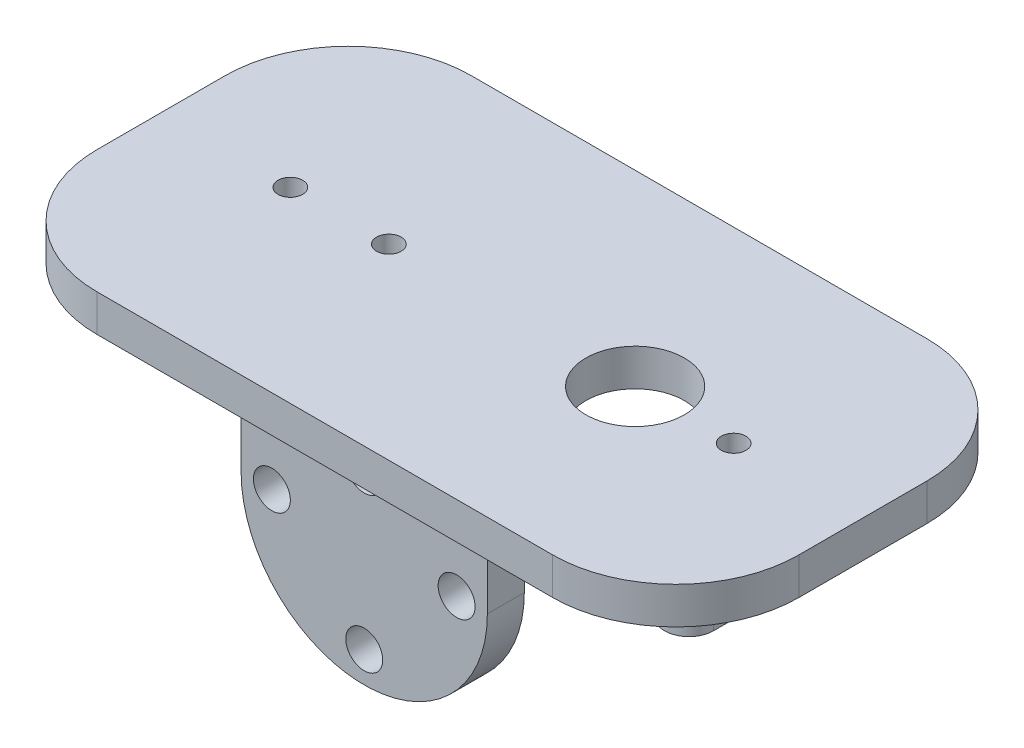
ISO-10303-21;
HEADER;
FILE_DESCRIPTION(('STEP AP214'),'2;1');
FILE_NAME('part.step','',(''),(''),'','','');
FILE_SCHEMA(('AUTOMOTIVE_DESIGN { 1 0 10303 214 1 1 1 1 }'));
ENDSEC;
DATA;
#1=APPLICATION_CONTEXT('core data for automotive mechanical design processes');
#2=APPLICATION_PROTOCOL_DEFINITION('international standard','automotive_design',2000,#1);
#3=PRODUCT_CONTEXT('',#1,'mechanical');
#4=PRODUCT('Part','Part','',(#3));
#5=PRODUCT_RELATED_PRODUCT_CATEGORY('part','',(#4));
#6=PRODUCT_DEFINITION_FORMATION('','',#4);
#7=PRODUCT_DEFINITION_CONTEXT('part definition',#1,'design');
#8=PRODUCT_DEFINITION('design','',#6,#7);
#9=PRODUCT_DEFINITION_SHAPE('','',#8);
#10=(LENGTH_UNIT() NAMED_UNIT(*) SI_UNIT(.MILLI.,.METRE.));
#11=(NAMED_UNIT(*) PLANE_ANGLE_UNIT() SI_UNIT($,.RADIAN.));
#12=(NAMED_UNIT(*) SI_UNIT($,.STERADIAN.) SOLID_ANGLE_UNIT());
#13=UNCERTAINTY_MEASURE_WITH_UNIT(LENGTH_MEASURE(1.E-05),#10,'distance_accuracy_value','');
#14=(GEOMETRIC_REPRESENTATION_CONTEXT(3) GLOBAL_UNCERTAINTY_ASSIGNED_CONTEXT((#13)) GLOBAL_UNIT_ASSIGNED_CONTEXT((#10,
#11,#12)) REPRESENTATION_CONTEXT('',''));
#15=CARTESIAN_POINT('',(0.,0.,0.));
#16=DIRECTION('',(0.,0.,1.));
#17=DIRECTION('',(1.,0.,0.));
#18=AXIS2_PLACEMENT_3D('',#15,#16,#17);
#19=CARTESIAN_POINT('',(-28.5,0.,-5.19999999999999));
#20=DIRECTION('',(0.,-1.,0.));
#21=DIRECTION('',(0.,0.,-1.));
#22=AXIS2_PLACEMENT_3D('',#19,#20,#21);
#23=PLANE('',#22);
#24=CARTESIAN_POINT('',(18.,0.,0.));
#25=DIRECTION('',(0.,1.,0.));
#26=DIRECTION('',(0.,0.,1.));
#27=AXIS2_PLACEMENT_3D('',#24,#25,#26);
#28=CIRCLE('',#27,0.99999999999999);
#29=CARTESIAN_POINT('',(18.,0.,0.99999999999999));
#30=VERTEX_POINT('',#29);
#31=EDGE_CURVE('E48',#30,#30,#28,.T.);
#32=ORIENTED_EDGE('',*,*,#31,.T.);
#33=EDGE_LOOP('',(#32));
#34=FACE_BOUND('',#33,.T.);
#35=CARTESIAN_POINT('',(-18.,0.,0.));
#36=DIRECTION('',(0.,-1.,0.));
#37=DIRECTION('',(0.,0.,-1.));
#38=AXIS2_PLACEMENT_3D('',#35,#36,#37);
#39=CIRCLE('',#38,0.99999999999999);
#40=CARTESIAN_POINT('',(-18.,0.,-0.99999999999999));
#41=VERTEX_POINT('',#40);
#42=EDGE_CURVE('E192',#41,#41,#39,.T.);
#43=ORIENTED_EDGE('',*,*,#42,.F.);
#44=EDGE_LOOP('',(#43));
#45=FACE_BOUND('',#44,.T.);
#46=CARTESIAN_POINT('',(10.,0.,0.));
#47=DIRECTION('',(0.,-1.,0.));
#48=DIRECTION('',(0.,0.,-1.));
#49=AXIS2_PLACEMENT_3D('',#46,#47,#48);
#50=CIRCLE('',#49,3.99999999999999);
#51=CARTESIAN_POINT('',(10.,0.,-3.99999999999999));
#52=VERTEX_POINT('',#51);
#53=EDGE_CURVE('E186',#52,#52,#50,.T.);
#54=ORIENTED_EDGE('',*,*,#53,.F.);
#55=EDGE_LOOP('',(#54));
#56=FACE_BOUND('',#55,.T.);
#57=DIRECTION('',(0.,0.,-1.));
#58=VECTOR('',#57,1.);
#59=CARTESIAN_POINT('',(-28.5,0.,15.2));
#60=LINE('',#59,#58);
#61=CARTESIAN_POINT('',(-28.5,0.,5.20000000000001));
#62=VERTEX_POINT('',#61);
#63=CARTESIAN_POINT('',(-28.5,0.,-5.19999999999999));
#64=VERTEX_POINT('',#63);
#65=EDGE_CURVE('E171',#62,#64,#60,.T.);
#66=ORIENTED_EDGE('',*,*,#65,.T.);
#67=CARTESIAN_POINT('',(-18.5,0.,-5.2));
#68=DIRECTION('',(0.,-1.,0.));
#69=DIRECTION('',(0.,0.,-1.));
#70=AXIS2_PLACEMENT_3D('',#67,#68,#69);
#71=CIRCLE('',#70,10.);
#72=CARTESIAN_POINT('',(-18.5,0.,-15.2));
#73=VERTEX_POINT('',#72);
#74=EDGE_CURVE('E69',#64,#73,#71,.T.);
#75=ORIENTED_EDGE('',*,*,#74,.T.);
#76=DIRECTION('',(1.,0.,0.));
#77=VECTOR('',#76,1.);
#78=CARTESIAN_POINT('',(-28.5,0.,-15.2));
#79=LINE('',#78,#77);
#80=CARTESIAN_POINT('',(18.5,0.,-15.2));
#81=VERTEX_POINT('',#80);
#82=EDGE_CURVE('E168',#73,#81,#79,.T.);
#83=ORIENTED_EDGE('',*,*,#82,.T.);
#84=CARTESIAN_POINT('',(18.5,0.,-5.2));
#85=DIRECTION('',(0.,-1.,0.));
#86=DIRECTION('',(0.,0.,-1.));
#87=AXIS2_PLACEMENT_3D('',#84,#85,#86);
#88=CIRCLE('',#87,10.);
#89=CARTESIAN_POINT('',(28.5,0.,-5.2));
#90=VERTEX_POINT('',#89);
#91=EDGE_CURVE('E158',#81,#90,#88,.T.);
#92=ORIENTED_EDGE('',*,*,#91,.T.);
#93=DIRECTION('',(0.,0.,1.));
#94=VECTOR('',#93,1.);
#95=CARTESIAN_POINT('',(28.5,0.,-15.2));
#96=LINE('',#95,#94);
#97=CARTESIAN_POINT('',(28.5,0.,5.2));
#98=VERTEX_POINT('',#97);
#99=EDGE_CURVE('E175',#90,#98,#96,.T.);
#100=ORIENTED_EDGE('',*,*,#99,.T.);
#101=CARTESIAN_POINT('',(18.5,0.,5.2));
#102=DIRECTION('',(0.,-1.,0.));
#103=DIRECTION('',(0.,0.,-1.));
#104=AXIS2_PLACEMENT_3D('',#101,#102,#103);
#105=CIRCLE('',#104,10.);
#106=CARTESIAN_POINT('',(18.5,0.,15.2));
#107=VERTEX_POINT('',#106);
#108=EDGE_CURVE('E161',#98,#107,#105,.T.);
#109=ORIENTED_EDGE('',*,*,#108,.T.);
#110=DIRECTION('',(-1.,0.,0.));
#111=VECTOR('',#110,1.);
#112=CARTESIAN_POINT('',(28.5,0.,15.2));
#113=LINE('',#112,#111);
#114=CARTESIAN_POINT('',(-18.5,0.,15.2));
#115=VERTEX_POINT('',#114);
#116=EDGE_CURVE('E173',#107,#115,#113,.T.);
#117=ORIENTED_EDGE('',*,*,#116,.T.);
#118=CARTESIAN_POINT('',(-18.5,0.,5.20000000000001));
#119=DIRECTION('',(0.,-1.,0.));
#120=DIRECTION('',(0.,0.,-1.));
#121=AXIS2_PLACEMENT_3D('',#118,#119,#120);
#122=CIRCLE('',#121,10.);
#123=EDGE_CURVE('E61',#115,#62,#122,.T.);
#124=ORIENTED_EDGE('',*,*,#123,.T.);
#125=EDGE_LOOP('',(#66,#75,#83,#92,#100,#109,#117,#124));
#126=FACE_BOUND('',#125,.T.);
#127=CARTESIAN_POINT('',(-10.,0.,0.));
#128=DIRECTION('',(0.,1.,0.));
#129=DIRECTION('',(0.,0.,1.));
#130=AXIS2_PLACEMENT_3D('',#127,#128,#129);
#131=CIRCLE('',#130,0.999999999999989);
#132=CARTESIAN_POINT('',(-10.,0.,0.999999999999989));
#133=VERTEX_POINT('',#132);
#134=EDGE_CURVE('E138',#133,#133,#131,.T.);
#135=ORIENTED_EDGE('',*,*,#134,.T.);
#136=EDGE_LOOP('',(#135));
#137=FACE_BOUND('',#136,.T.);
#138=ADVANCED_FACE('F45',(#34,#45,#56,#126,#137),#23,.T.);
#139=CARTESIAN_POINT('',(-28.5,3.,-15.2));
#140=DIRECTION('',(0.,0.,-1.));
#141=DIRECTION('',(-1.,0.,0.));
#142=AXIS2_PLACEMENT_3D('',#139,#140,#141);
#143=PLANE('',#142);
#144=ORIENTED_EDGE('',*,*,#82,.F.);
#145=DIRECTION('',(0.,-1.,0.));
#146=VECTOR('',#145,1.);
#147=CARTESIAN_POINT('',(-18.5,3.,-15.2));
#148=LINE('',#147,#146);
#149=CARTESIAN_POINT('',(-18.5,3.,-15.2));
#150=VERTEX_POINT('',#149);
#151=EDGE_CURVE('E152',#73,#150,#148,.F.);
#152=ORIENTED_EDGE('',*,*,#151,.T.);
#153=DIRECTION('',(1.,0.,0.));
#154=VECTOR('',#153,1.);
#155=CARTESIAN_POINT('',(-28.5,3.,-15.2));
#156=LINE('',#155,#154);
#157=CARTESIAN_POINT('',(18.5,3.,-15.2));
#158=VERTEX_POINT('',#157);
#159=EDGE_CURVE('E167',#150,#158,#156,.T.);
#160=ORIENTED_EDGE('',*,*,#159,.T.);
#161=DIRECTION('',(0.,-1.,0.));
#162=VECTOR('',#161,1.);
#163=CARTESIAN_POINT('',(18.5,3.,-15.2));
#164=LINE('',#163,#162);
#165=EDGE_CURVE('E154',#158,#81,#164,.T.);
#166=ORIENTED_EDGE('',*,*,#165,.T.);
#167=EDGE_LOOP('',(#144,#152,#160,#166));
#168=FACE_BOUND('',#167,.T.);
#169=ADVANCED_FACE('F218',(#168),#143,.T.);
#170=CARTESIAN_POINT('',(-28.5,3.,15.2));
#171=DIRECTION('',(-1.,0.,0.));
#172=DIRECTION('',(0.,0.,1.));
#173=AXIS2_PLACEMENT_3D('',#170,#171,#172);
#174=PLANE('',#173);
#175=DIRECTION('',(0.,0.,-1.));
#176=VECTOR('',#175,1.);
#177=CARTESIAN_POINT('',(-28.5,3.,15.2));
#178=LINE('',#177,#176);
#179=CARTESIAN_POINT('',(-28.5,3.,5.20000000000001));
#180=VERTEX_POINT('',#179);
#181=CARTESIAN_POINT('',(-28.5,3.,-5.19999999999999));
#182=VERTEX_POINT('',#181);
#183=EDGE_CURVE('E121',#180,#182,#178,.T.);
#184=ORIENTED_EDGE('',*,*,#183,.T.);
#185=DIRECTION('',(0.,-1.,0.));
#186=VECTOR('',#185,1.);
#187=CARTESIAN_POINT('',(-28.5,3.,-5.2));
#188=LINE('',#187,#186);
#189=EDGE_CURVE('E163',#182,#64,#188,.T.);
#190=ORIENTED_EDGE('',*,*,#189,.T.);
#191=ORIENTED_EDGE('',*,*,#65,.F.);
#192=DIRECTION('',(0.,-1.,0.));
#193=VECTOR('',#192,1.);
#194=CARTESIAN_POINT('',(-28.5,3.,5.20000000000001));
#195=LINE('',#194,#193);
#196=EDGE_CURVE('E165',#62,#180,#195,.F.);
#197=ORIENTED_EDGE('',*,*,#196,.T.);
#198=EDGE_LOOP('',(#184,#190,#191,#197));
#199=FACE_BOUND('',#198,.T.);
#200=ADVANCED_FACE('F231',(#199),#174,.T.);
#201=CARTESIAN_POINT('',(28.5,3.,-15.2));
#202=DIRECTION('',(1.,0.,0.));
#203=DIRECTION('',(0.,0.,-1.));
#204=AXIS2_PLACEMENT_3D('',#201,#202,#203);
#205=PLANE('',#204);
#206=ORIENTED_EDGE('',*,*,#99,.F.);
#207=DIRECTION('',(0.,-1.,0.));
#208=VECTOR('',#207,1.);
#209=CARTESIAN_POINT('',(28.5,3.,-5.2));
#210=LINE('',#209,#208);
#211=CARTESIAN_POINT('',(28.5,3.,-5.2));
#212=VERTEX_POINT('',#211);
#213=EDGE_CURVE('E140',#90,#212,#210,.F.);
#214=ORIENTED_EDGE('',*,*,#213,.T.);
#215=DIRECTION('',(0.,0.,1.));
#216=VECTOR('',#215,1.);
#217=CARTESIAN_POINT('',(28.5,3.,-15.2));
#218=LINE('',#217,#216);
#219=CARTESIAN_POINT('',(28.5,3.,5.2));
#220=VERTEX_POINT('',#219);
#221=EDGE_CURVE('E135',#212,#220,#218,.T.);
#222=ORIENTED_EDGE('',*,*,#221,.T.);
#223=DIRECTION('',(0.,-1.,0.));
#224=VECTOR('',#223,1.);
#225=CARTESIAN_POINT('',(28.5,3.,5.2));
#226=LINE('',#225,#224);
#227=EDGE_CURVE('E145',#220,#98,#226,.T.);
#228=ORIENTED_EDGE('',*,*,#227,.T.);
#229=EDGE_LOOP('',(#206,#214,#222,#228));
#230=FACE_BOUND('',#229,.T.);
#231=ADVANCED_FACE('F237',(#230),#205,.T.);
#232=CARTESIAN_POINT('',(28.5,3.,15.2));
#233=DIRECTION('',(0.,0.,1.));
#234=DIRECTION('',(1.,0.,0.));
#235=AXIS2_PLACEMENT_3D('',#232,#233,#234);
#236=PLANE('',#235);
#237=DIRECTION('',(-1.,0.,0.));
#238=VECTOR('',#237,1.);
#239=CARTESIAN_POINT('',(28.5,3.,15.2));
#240=LINE('',#239,#238);
#241=CARTESIAN_POINT('',(18.5,3.,15.2));
#242=VERTEX_POINT('',#241);
#243=CARTESIAN_POINT('',(-18.5,3.,15.2));
#244=VERTEX_POINT('',#243);
#245=EDGE_CURVE('E118',#242,#244,#240,.T.);
#246=ORIENTED_EDGE('',*,*,#245,.T.);
#247=DIRECTION('',(0.,-1.,0.));
#248=VECTOR('',#247,1.);
#249=CARTESIAN_POINT('',(-18.5,3.,15.2));
#250=LINE('',#249,#248);
#251=EDGE_CURVE('E132',#244,#115,#250,.T.);
#252=ORIENTED_EDGE('',*,*,#251,.T.);
#253=ORIENTED_EDGE('',*,*,#116,.F.);
#254=DIRECTION('',(0.,-1.,0.));
#255=VECTOR('',#254,1.);
#256=CARTESIAN_POINT('',(18.5,3.,15.2));
#257=LINE('',#256,#255);
#258=EDGE_CURVE('E134',#107,#242,#257,.F.);
#259=ORIENTED_EDGE('',*,*,#258,.T.);
#260=EDGE_LOOP('',(#246,#252,#253,#259));
#261=FACE_BOUND('',#260,.T.);
#262=ADVANCED_FACE('F130',(#261),#236,.T.);
#263=CARTESIAN_POINT('',(0.,3.,0.));
#264=DIRECTION('',(0.,-1.,0.));
#265=DIRECTION('',(0.,0.,-1.));
#266=AXIS2_PLACEMENT_3D('',#263,#264,#265);
#267=PLANE('',#266);
#268=CARTESIAN_POINT('',(18.,3.,0.));
#269=DIRECTION('',(0.,1.,0.));
#270=DIRECTION('',(0.,0.,1.));
#271=AXIS2_PLACEMENT_3D('',#268,#269,#270);
#272=CIRCLE('',#271,0.99999999999999);
#273=CARTESIAN_POINT('',(18.,3.,0.99999999999999));
#274=VERTEX_POINT('',#273);
#275=EDGE_CURVE('E13',#274,#274,#272,.T.);
#276=ORIENTED_EDGE('',*,*,#275,.F.);
#277=EDGE_LOOP('',(#276));
#278=FACE_BOUND('',#277,.T.);
#279=CARTESIAN_POINT('',(-10.,3.,0.));
#280=DIRECTION('',(0.,1.,0.));
#281=DIRECTION('',(0.,0.,1.));
#282=AXIS2_PLACEMENT_3D('',#279,#280,#281);
#283=CIRCLE('',#282,0.99999999999999);
#284=CARTESIAN_POINT('',(-10.,3.,0.99999999999999));
#285=VERTEX_POINT('',#284);
#286=EDGE_CURVE('E53',#285,#285,#283,.T.);
#287=ORIENTED_EDGE('',*,*,#286,.F.);
#288=EDGE_LOOP('',(#287));
#289=FACE_BOUND('',#288,.T.);
#290=CARTESIAN_POINT('',(-18.,3.,0.));
#291=DIRECTION('',(0.,-1.,0.));
#292=DIRECTION('',(0.,0.,-1.));
#293=AXIS2_PLACEMENT_3D('',#290,#291,#292);
#294=CIRCLE('',#293,0.99999999999999);
#295=CARTESIAN_POINT('',(-18.,3.,-0.99999999999999));
#296=VERTEX_POINT('',#295);
#297=EDGE_CURVE('E189',#296,#296,#294,.T.);
#298=ORIENTED_EDGE('',*,*,#297,.T.);
#299=EDGE_LOOP('',(#298));
#300=FACE_BOUND('',#299,.T.);
#301=CARTESIAN_POINT('',(10.,3.,0.));
#302=DIRECTION('',(0.,-1.,0.));
#303=DIRECTION('',(0.,0.,-1.));
#304=AXIS2_PLACEMENT_3D('',#301,#302,#303);
#305=CIRCLE('',#304,3.99999999999999);
#306=CARTESIAN_POINT('',(10.,3.,-3.99999999999999));
#307=VERTEX_POINT('',#306);
#308=EDGE_CURVE('E178',#307,#307,#305,.T.);
#309=ORIENTED_EDGE('',*,*,#308,.T.);
#310=EDGE_LOOP('',(#309));
#311=FACE_BOUND('',#310,.T.);
#312=ORIENTED_EDGE('',*,*,#159,.F.);
#313=CARTESIAN_POINT('',(-18.5,3.,-5.2));
#314=DIRECTION('',(0.,-1.,0.));
#315=DIRECTION('',(0.,0.,-1.));
#316=AXIS2_PLACEMENT_3D('',#313,#314,#315);
#317=CIRCLE('',#316,10.);
#318=EDGE_CURVE('E148',#150,#182,#317,.F.);
#319=ORIENTED_EDGE('',*,*,#318,.T.);
#320=ORIENTED_EDGE('',*,*,#183,.F.);
#321=CARTESIAN_POINT('',(-18.5,3.,5.20000000000001));
#322=DIRECTION('',(0.,-1.,0.));
#323=DIRECTION('',(0.,0.,-1.));
#324=AXIS2_PLACEMENT_3D('',#321,#322,#323);
#325=CIRCLE('',#324,10.);
#326=EDGE_CURVE('E114',#180,#244,#325,.F.);
#327=ORIENTED_EDGE('',*,*,#326,.T.);
#328=ORIENTED_EDGE('',*,*,#245,.F.);
#329=CARTESIAN_POINT('',(18.5,3.,5.2));
#330=DIRECTION('',(0.,-1.,0.));
#331=DIRECTION('',(0.,0.,-1.));
#332=AXIS2_PLACEMENT_3D('',#329,#330,#331);
#333=CIRCLE('',#332,10.);
#334=EDGE_CURVE('E125',#242,#220,#333,.F.);
#335=ORIENTED_EDGE('',*,*,#334,.T.);
#336=ORIENTED_EDGE('',*,*,#221,.F.);
#337=CARTESIAN_POINT('',(18.5,3.,-5.2));
#338=DIRECTION('',(0.,-1.,0.));
#339=DIRECTION('',(0.,0.,-1.));
#340=AXIS2_PLACEMENT_3D('',#337,#338,#339);
#341=CIRCLE('',#340,10.);
#342=EDGE_CURVE('E126',#212,#158,#341,.F.);
#343=ORIENTED_EDGE('',*,*,#342,.T.);
#344=EDGE_LOOP('',(#312,#319,#320,#327,#328,#335,#336,#343));
#345=FACE_BOUND('',#344,.T.);
#346=ADVANCED_FACE('F117',(#278,#289,#300,#311,#345),#267,.F.);
#347=CARTESIAN_POINT('',(18.5,3.,5.2));
#348=DIRECTION('',(0.,-1.,0.));
#349=DIRECTION('',(0.,0.,-1.));
#350=AXIS2_PLACEMENT_3D('',#347,#348,#349);
#351=CYLINDRICAL_SURFACE('',#350,10.);
#352=ORIENTED_EDGE('',*,*,#334,.F.);
#353=ORIENTED_EDGE('',*,*,#258,.F.);
#354=ORIENTED_EDGE('',*,*,#108,.F.);
#355=ORIENTED_EDGE('',*,*,#227,.F.);
#356=EDGE_LOOP('',(#352,#353,#354,#355));
#357=FACE_BOUND('',#356,.T.);
#358=ADVANCED_FACE('F202',(#357),#351,.T.);
#359=CARTESIAN_POINT('',(-18.5,3.,5.20000000000001));
#360=DIRECTION('',(0.,-1.,0.));
#361=DIRECTION('',(0.,0.,-1.));
#362=AXIS2_PLACEMENT_3D('',#359,#360,#361);
#363=CYLINDRICAL_SURFACE('',#362,10.);
#364=ORIENTED_EDGE('',*,*,#326,.F.);
#365=ORIENTED_EDGE('',*,*,#196,.F.);
#366=ORIENTED_EDGE('',*,*,#123,.F.);
#367=ORIENTED_EDGE('',*,*,#251,.F.);
#368=EDGE_LOOP('',(#364,#365,#366,#367));
#369=FACE_BOUND('',#368,.T.);
#370=ADVANCED_FACE('F137',(#369),#363,.T.);
#371=CARTESIAN_POINT('',(18.5,3.,-5.2));
#372=DIRECTION('',(0.,-1.,0.));
#373=DIRECTION('',(0.,0.,-1.));
#374=AXIS2_PLACEMENT_3D('',#371,#372,#373);
#375=CYLINDRICAL_SURFACE('',#374,10.);
#376=ORIENTED_EDGE('',*,*,#342,.F.);
#377=ORIENTED_EDGE('',*,*,#213,.F.);
#378=ORIENTED_EDGE('',*,*,#91,.F.);
#379=ORIENTED_EDGE('',*,*,#165,.F.);
#380=EDGE_LOOP('',(#376,#377,#378,#379));
#381=FACE_BOUND('',#380,.T.);
#382=ADVANCED_FACE('F248',(#381),#375,.T.);
#383=CARTESIAN_POINT('',(-18.5,3.,-5.2));
#384=DIRECTION('',(0.,-1.,0.));
#385=DIRECTION('',(0.,0.,-1.));
#386=AXIS2_PLACEMENT_3D('',#383,#384,#385);
#387=CYLINDRICAL_SURFACE('',#386,10.);
#388=ORIENTED_EDGE('',*,*,#318,.F.);
#389=ORIENTED_EDGE('',*,*,#151,.F.);
#390=ORIENTED_EDGE('',*,*,#74,.F.);
#391=ORIENTED_EDGE('',*,*,#189,.F.);
#392=EDGE_LOOP('',(#388,#389,#390,#391));
#393=FACE_BOUND('',#392,.T.);
#394=ADVANCED_FACE('F243',(#393),#387,.T.);
#395=CARTESIAN_POINT('',(-18.,0.,0.));
#396=DIRECTION('',(0.,-1.,0.));
#397=DIRECTION('',(0.,0.,-1.));
#398=AXIS2_PLACEMENT_3D('',#395,#396,#397);
#399=CYLINDRICAL_SURFACE('',#398,0.99999999999999);
#400=ORIENTED_EDGE('',*,*,#297,.F.);
#401=EDGE_LOOP('',(#400));
#402=FACE_BOUND('',#401,.T.);
#403=ORIENTED_EDGE('',*,*,#42,.T.);
#404=EDGE_LOOP('',(#403));
#405=FACE_BOUND('',#404,.T.);
#406=ADVANCED_FACE('F213',(#402,#405),#399,.F.);
#407=CARTESIAN_POINT('',(10.,0.,0.));
#408=DIRECTION('',(0.,-1.,0.));
#409=DIRECTION('',(0.,0.,-1.));
#410=AXIS2_PLACEMENT_3D('',#407,#408,#409);
#411=CYLINDRICAL_SURFACE('',#410,3.99999999999999);
#412=ORIENTED_EDGE('',*,*,#308,.F.);
#413=EDGE_LOOP('',(#412));
#414=FACE_BOUND('',#413,.T.);
#415=ORIENTED_EDGE('',*,*,#53,.T.);
#416=EDGE_LOOP('',(#415));
#417=FACE_BOUND('',#416,.T.);
#418=ADVANCED_FACE('F209',(#414,#417),#411,.F.);
#419=CARTESIAN_POINT('',(18.,3.,0.));
#420=DIRECTION('',(0.,1.,0.));
#421=DIRECTION('',(0.,0.,1.));
#422=AXIS2_PLACEMENT_3D('',#419,#420,#421);
#423=CYLINDRICAL_SURFACE('',#422,0.99999999999999);
#424=ORIENTED_EDGE('',*,*,#31,.F.);
#425=EDGE_LOOP('',(#424));
#426=FACE_BOUND('',#425,.T.);
#427=ORIENTED_EDGE('',*,*,#275,.T.);
#428=EDGE_LOOP('',(#427));
#429=FACE_BOUND('',#428,.T.);
#430=ADVANCED_FACE('F212',(#426,#429),#423,.F.);
#431=CARTESIAN_POINT('',(-10.,3.,0.));
#432=DIRECTION('',(0.,1.,0.));
#433=DIRECTION('',(0.,0.,1.));
#434=AXIS2_PLACEMENT_3D('',#431,#432,#433);
#435=CYLINDRICAL_SURFACE('',#434,0.99999999999999);
#436=ORIENTED_EDGE('',*,*,#134,.F.);
#437=EDGE_LOOP('',(#436));
#438=FACE_BOUND('',#437,.T.);
#439=ORIENTED_EDGE('',*,*,#286,.T.);
#440=EDGE_LOOP('',(#439));
#441=FACE_BOUND('',#440,.T.);
#442=ADVANCED_FACE('F198',(#438,#441),#435,.F.);
#443=CLOSED_SHELL('',(#138,#169,#200,#231,#262,#346,#358,#370,#382,#394,#406,#418,#430,#442));
#444=MANIFOLD_SOLID_BREP('B2',#443);
#445=CARTESIAN_POINT('',(-28.5,0.,-5.19999999999999));
#446=DIRECTION('',(0.,-1.,0.));
#447=DIRECTION('',(0.,0.,-1.));
#448=AXIS2_PLACEMENT_3D('',#445,#446,#447);
#449=PLANE('',#448);
#450=DIRECTION('',(0.,0.,-1.));
#451=VECTOR('',#450,1.);
#452=CARTESIAN_POINT('',(16.3736323404437,0.,-4.));
#453=LINE('',#452,#451);
#454=CARTESIAN_POINT('',(16.3736323404437,0.,4.));
#455=VERTEX_POINT('',#454);
#456=CARTESIAN_POINT('',(16.3736323404437,0.,-4.));
#457=VERTEX_POINT('',#456);
#458=EDGE_CURVE('E431',#455,#457,#453,.T.);
#459=ORIENTED_EDGE('',*,*,#458,.F.);
#460=CARTESIAN_POINT('',(18.3736323404437,0.,4.));
#461=DIRECTION('',(0.,-1.,0.));
#462=DIRECTION('',(0.,0.,1.));
#463=AXIS2_PLACEMENT_3D('',#460,#461,#462);
#464=CIRCLE('',#463,2.);
#465=CARTESIAN_POINT('',(20.3736323404437,0.,4.));
#466=VERTEX_POINT('',#465);
#467=EDGE_CURVE('E423',#466,#455,#464,.T.);
#468=ORIENTED_EDGE('',*,*,#467,.F.);
#469=DIRECTION('',(0.,0.,1.));
#470=VECTOR('',#469,1.);
#471=CARTESIAN_POINT('',(20.3736323404437,0.,4.));
#472=LINE('',#471,#470);
#473=CARTESIAN_POINT('',(20.3736323404437,0.,-4.));
#474=VERTEX_POINT('',#473);
#475=EDGE_CURVE('E430',#474,#466,#472,.T.);
#476=ORIENTED_EDGE('',*,*,#475,.F.);
#477=CARTESIAN_POINT('',(18.3736323404437,0.,-4.));
#478=DIRECTION('',(0.,-1.,0.));
#479=DIRECTION('',(0.,0.,1.));
#480=AXIS2_PLACEMENT_3D('',#477,#478,#479);
#481=CIRCLE('',#480,2.);
#482=EDGE_CURVE('E392',#457,#474,#481,.T.);
#483=ORIENTED_EDGE('',*,*,#482,.F.);
#484=EDGE_LOOP('',(#459,#468,#476,#483));
#485=FACE_BOUND('',#484,.T.);
#486=ADVANCED_FACE('F376',(#485),#449,.F.);
#487=CARTESIAN_POINT('',(18.7492490636064,-2.,0.11463342872871));
#488=DIRECTION('',(0.,1.,0.));
#489=DIRECTION('',(0.,0.,1.));
#490=AXIS2_PLACEMENT_3D('',#487,#488,#489);
#491=PLANE('',#490);
#492=CARTESIAN_POINT('',(18.7492490636064,-2.,0.11463342872871));
#493=DIRECTION('',(0.,-1.,0.));
#494=DIRECTION('',(0.,0.,-1.));
#495=AXIS2_PLACEMENT_3D('',#492,#493,#494);
#496=CIRCLE('',#495,0.99999999999999);
#497=CARTESIAN_POINT('',(18.7492490636064,-2.,-0.88536657127128));
#498=VERTEX_POINT('',#497);
#499=EDGE_CURVE('E384',#498,#498,#496,.T.);
#500=ORIENTED_EDGE('',*,*,#499,.T.);
#501=EDGE_LOOP('',(#500));
#502=FACE_BOUND('',#501,.T.);
#503=ADVANCED_FACE('F455',(#502),#491,.F.);
#504=CARTESIAN_POINT('',(18.7492490636064,-7.,0.11463342872871));
#505=DIRECTION('',(0.,-1.,0.));
#506=DIRECTION('',(0.,0.,-1.));
#507=AXIS2_PLACEMENT_3D('',#504,#505,#506);
#508=CYLINDRICAL_SURFACE('',#507,0.99999999999999);
#509=ORIENTED_EDGE('',*,*,#499,.F.);
#510=EDGE_LOOP('',(#509));
#511=FACE_BOUND('',#510,.T.);
#512=CARTESIAN_POINT('',(18.7492490636064,-7.,0.11463342872871));
#513=DIRECTION('',(0.,-1.,0.));
#514=DIRECTION('',(0.,0.,-1.));
#515=AXIS2_PLACEMENT_3D('',#512,#513,#514);
#516=CIRCLE('',#515,0.99999999999999);
#517=CARTESIAN_POINT('',(18.7492490636064,-7.,-0.88536657127128));
#518=VERTEX_POINT('',#517);
#519=EDGE_CURVE('E43',#518,#518,#516,.T.);
#520=ORIENTED_EDGE('',*,*,#519,.T.);
#521=EDGE_LOOP('',(#520));
#522=FACE_BOUND('',#521,.T.);
#523=ADVANCED_FACE('F457',(#511,#522),#508,.F.);
#524=CARTESIAN_POINT('',(20.3736323404437,-7.,4.));
#525=DIRECTION('',(-1.,0.,0.));
#526=DIRECTION('',(0.,0.,1.));
#527=AXIS2_PLACEMENT_3D('',#524,#525,#526);
#528=PLANE('',#527);
#529=ORIENTED_EDGE('',*,*,#475,.T.);
#530=DIRECTION('',(0.,1.,0.));
#531=VECTOR('',#530,1.);
#532=CARTESIAN_POINT('',(20.3736323404437,-7.,4.));
#533=LINE('',#532,#531);
#534=CARTESIAN_POINT('',(20.3736323404437,-7.,4.));
#535=VERTEX_POINT('',#534);
#536=EDGE_CURVE('E429',#535,#466,#533,.T.);
#537=ORIENTED_EDGE('',*,*,#536,.F.);
#538=DIRECTION('',(0.,0.,1.));
#539=VECTOR('',#538,1.);
#540=CARTESIAN_POINT('',(20.3736323404437,-7.,4.));
#541=LINE('',#540,#539);
#542=CARTESIAN_POINT('',(20.3736323404437,-7.,-4.));
#543=VERTEX_POINT('',#542);
#544=EDGE_CURVE('E410',#543,#535,#541,.T.);
#545=ORIENTED_EDGE('',*,*,#544,.F.);
#546=DIRECTION('',(0.,1.,0.));
#547=VECTOR('',#546,1.);
#548=CARTESIAN_POINT('',(20.3736323404437,-7.,-4.));
#549=LINE('',#548,#547);
#550=EDGE_CURVE('E442',#543,#474,#549,.T.);
#551=ORIENTED_EDGE('',*,*,#550,.T.);
#552=EDGE_LOOP('',(#529,#537,#545,#551));
#553=FACE_BOUND('',#552,.T.);
#554=ADVANCED_FACE('F460',(#553),#528,.F.);
#555=CARTESIAN_POINT('',(18.3736323404437,-7.,4.));
#556=DIRECTION('',(0.,1.,0.));
#557=DIRECTION('',(0.,0.,1.));
#558=AXIS2_PLACEMENT_3D('',#555,#556,#557);
#559=CYLINDRICAL_SURFACE('',#558,2.);
#560=ORIENTED_EDGE('',*,*,#467,.T.);
#561=DIRECTION('',(0.,1.,0.));
#562=VECTOR('',#561,1.);
#563=CARTESIAN_POINT('',(16.3736323404437,-7.,4.));
#564=LINE('',#563,#562);
#565=CARTESIAN_POINT('',(16.3736323404437,-7.,4.));
#566=VERTEX_POINT('',#565);
#567=EDGE_CURVE('E427',#566,#455,#564,.T.);
#568=ORIENTED_EDGE('',*,*,#567,.F.);
#569=CARTESIAN_POINT('',(18.3736323404437,-7.,4.));
#570=DIRECTION('',(0.,-1.,0.));
#571=DIRECTION('',(0.,0.,1.));
#572=AXIS2_PLACEMENT_3D('',#569,#570,#571);
#573=CIRCLE('',#572,2.);
#574=EDGE_CURVE('E449',#535,#566,#573,.T.);
#575=ORIENTED_EDGE('',*,*,#574,.F.);
#576=ORIENTED_EDGE('',*,*,#536,.T.);
#577=EDGE_LOOP('',(#560,#568,#575,#576));
#578=FACE_BOUND('',#577,.T.);
#579=ADVANCED_FACE('F424',(#578),#559,.T.);
#580=CARTESIAN_POINT('',(18.3736323404437,-7.,-4.));
#581=DIRECTION('',(0.,1.,0.));
#582=DIRECTION('',(0.,0.,1.));
#583=AXIS2_PLACEMENT_3D('',#580,#581,#582);
#584=PLANE('',#583);
#585=ORIENTED_EDGE('',*,*,#519,.F.);
#586=EDGE_LOOP('',(#585));
#587=FACE_BOUND('',#586,.T.);
#588=CARTESIAN_POINT('',(18.3736323404437,-7.,-4.));
#589=DIRECTION('',(0.,-1.,0.));
#590=DIRECTION('',(0.,0.,1.));
#591=AXIS2_PLACEMENT_3D('',#588,#589,#590);
#592=CIRCLE('',#591,2.);
#593=CARTESIAN_POINT('',(16.3736323404437,-7.,-4.));
#594=VERTEX_POINT('',#593);
#595=EDGE_CURVE('E435',#594,#543,#592,.T.);
#596=ORIENTED_EDGE('',*,*,#595,.T.);
#597=ORIENTED_EDGE('',*,*,#544,.T.);
#598=ORIENTED_EDGE('',*,*,#574,.T.);
#599=DIRECTION('',(0.,0.,-1.));
#600=VECTOR('',#599,1.);
#601=CARTESIAN_POINT('',(16.3736323404437,-7.,-4.));
#602=LINE('',#601,#600);
#603=EDGE_CURVE('E438',#566,#594,#602,.T.);
#604=ORIENTED_EDGE('',*,*,#603,.T.);
#605=EDGE_LOOP('',(#596,#597,#598,#604));
#606=FACE_BOUND('',#605,.T.);
#607=ADVANCED_FACE('F463',(#587,#606),#584,.F.);
#608=CARTESIAN_POINT('',(18.3736323404437,-7.,-4.));
#609=DIRECTION('',(0.,1.,0.));
#610=DIRECTION('',(0.,0.,1.));
#611=AXIS2_PLACEMENT_3D('',#608,#609,#610);
#612=CYLINDRICAL_SURFACE('',#611,2.);
#613=ORIENTED_EDGE('',*,*,#482,.T.);
#614=ORIENTED_EDGE('',*,*,#550,.F.);
#615=ORIENTED_EDGE('',*,*,#595,.F.);
#616=DIRECTION('',(0.,1.,0.));
#617=VECTOR('',#616,1.);
#618=CARTESIAN_POINT('',(16.3736323404437,-7.,-4.));
#619=LINE('',#618,#617);
#620=EDGE_CURVE('E439',#594,#457,#619,.T.);
#621=ORIENTED_EDGE('',*,*,#620,.T.);
#622=EDGE_LOOP('',(#613,#614,#615,#621));
#623=FACE_BOUND('',#622,.T.);
#624=ADVANCED_FACE('F465',(#623),#612,.T.);
#625=CARTESIAN_POINT('',(16.3736323404437,-7.,-4.));
#626=DIRECTION('',(1.,0.,0.));
#627=DIRECTION('',(0.,0.,-1.));
#628=AXIS2_PLACEMENT_3D('',#625,#626,#627);
#629=PLANE('',#628);
#630=ORIENTED_EDGE('',*,*,#458,.T.);
#631=ORIENTED_EDGE('',*,*,#620,.F.);
#632=ORIENTED_EDGE('',*,*,#603,.F.);
#633=ORIENTED_EDGE('',*,*,#567,.T.);
#634=EDGE_LOOP('',(#630,#631,#632,#633));
#635=FACE_BOUND('',#634,.T.);
#636=ADVANCED_FACE('F437',(#635),#629,.F.);
#637=CLOSED_SHELL('',(#486,#503,#523,#554,#579,#607,#624,#636));
#638=MANIFOLD_SOLID_BREP('B7',#637);
#639=CARTESIAN_POINT('',(-28.5,0.,-5.19999999999999));
#640=DIRECTION('',(0.,-1.,0.));
#641=DIRECTION('',(0.,0.,-1.));
#642=AXIS2_PLACEMENT_3D('',#639,#640,#641);
#643=PLANE('',#642);
#644=DIRECTION('',(-1.,0.,0.));
#645=VECTOR('',#644,1.);
#646=CARTESIAN_POINT('',(10.,0.,9.00000000000001));
#647=LINE('',#646,#645);
#648=CARTESIAN_POINT('',(10.,0.,9.00000000000001));
#649=VERTEX_POINT('',#648);
#650=CARTESIAN_POINT('',(-10.,0.,9.00000000000001));
#651=VERTEX_POINT('',#650);
#652=EDGE_CURVE('E545',#649,#651,#647,.T.);
#653=ORIENTED_EDGE('',*,*,#652,.T.);
#654=DIRECTION('',(0.,0.,1.));
#655=VECTOR('',#654,1.);
#656=CARTESIAN_POINT('',(-10.,0.,9.00000000000001));
#657=LINE('',#656,#655);
#658=CARTESIAN_POINT('',(-10.,0.,12.));
#659=VERTEX_POINT('',#658);
#660=EDGE_CURVE('E592',#651,#659,#657,.T.);
#661=ORIENTED_EDGE('',*,*,#660,.T.);
#662=DIRECTION('',(-1.,0.,0.));
#663=VECTOR('',#662,1.);
#664=CARTESIAN_POINT('',(10.,0.,12.));
#665=LINE('',#664,#663);
#666=CARTESIAN_POINT('',(10.,0.,12.));
#667=VERTEX_POINT('',#666);
#668=EDGE_CURVE('E603',#667,#659,#665,.T.);
#669=ORIENTED_EDGE('',*,*,#668,.F.);
#670=DIRECTION('',(0.,0.,1.));
#671=VECTOR('',#670,1.);
#672=CARTESIAN_POINT('',(10.,0.,9.00000000000001));
#673=LINE('',#672,#671);
#674=EDGE_CURVE('E578',#649,#667,#673,.T.);
#675=ORIENTED_EDGE('',*,*,#674,.F.);
#676=EDGE_LOOP('',(#653,#661,#669,#675));
#677=FACE_BOUND('',#676,.T.);
#678=ADVANCED_FACE('F542',(#677),#643,.F.);
#679=CARTESIAN_POINT('',(-10.,0.,9.00000000000001));
#680=DIRECTION('',(-1.,0.,0.));
#681=DIRECTION('',(0.,0.,1.));
#682=AXIS2_PLACEMENT_3D('',#679,#680,#681);
#683=PLANE('',#682);
#684=DIRECTION('',(0.,-1.,0.));
#685=VECTOR('',#684,1.);
#686=CARTESIAN_POINT('',(-10.,0.,12.));
#687=LINE('',#686,#685);
#688=CARTESIAN_POINT('',(-10.,-7.,12.));
#689=VERTEX_POINT('',#688);
#690=EDGE_CURVE('E589',#659,#689,#687,.T.);
#691=ORIENTED_EDGE('',*,*,#690,.F.);
#692=ORIENTED_EDGE('',*,*,#660,.F.);
#693=DIRECTION('',(0.,-1.,0.));
#694=VECTOR('',#693,1.);
#695=CARTESIAN_POINT('',(-10.,0.,9.00000000000001));
#696=LINE('',#695,#694);
#697=CARTESIAN_POINT('',(-10.,-7.,9.00000000000001));
#698=VERTEX_POINT('',#697);
#699=EDGE_CURVE('E591',#651,#698,#696,.T.);
#700=ORIENTED_EDGE('',*,*,#699,.T.);
#701=DIRECTION('',(0.,0.,1.));
#702=VECTOR('',#701,1.);
#703=CARTESIAN_POINT('',(-10.,-7.,9.00000000000001));
#704=LINE('',#703,#702);
#705=EDGE_CURVE('E570',#698,#689,#704,.T.);
#706=ORIENTED_EDGE('',*,*,#705,.T.);
#707=EDGE_LOOP('',(#691,#692,#700,#706));
#708=FACE_BOUND('',#707,.T.);
#709=ADVANCED_FACE('F587',(#708),#683,.T.);
#710=CARTESIAN_POINT('',(10.,-7.,9.00000000000001));
#711=DIRECTION('',(1.,0.,0.));
#712=DIRECTION('',(0.,0.,-1.));
#713=AXIS2_PLACEMENT_3D('',#710,#711,#712);
#714=PLANE('',#713);
#715=DIRECTION('',(0.,1.,0.));
#716=VECTOR('',#715,1.);
#717=CARTESIAN_POINT('',(10.,-7.,12.));
#718=LINE('',#717,#716);
#719=CARTESIAN_POINT('',(10.,-7.,12.));
#720=VERTEX_POINT('',#719);
#721=EDGE_CURVE('E600',#720,#667,#718,.T.);
#722=ORIENTED_EDGE('',*,*,#721,.F.);
#723=DIRECTION('',(0.,0.,1.));
#724=VECTOR('',#723,1.);
#725=CARTESIAN_POINT('',(10.,-7.,9.00000000000001));
#726=LINE('',#725,#724);
#727=CARTESIAN_POINT('',(10.,-7.,9.00000000000001));
#728=VERTEX_POINT('',#727);
#729=EDGE_CURVE('E560',#728,#720,#726,.T.);
#730=ORIENTED_EDGE('',*,*,#729,.F.);
#731=DIRECTION('',(0.,1.,0.));
#732=VECTOR('',#731,1.);
#733=CARTESIAN_POINT('',(10.,-7.,9.00000000000001));
#734=LINE('',#733,#732);
#735=EDGE_CURVE('E608',#728,#649,#734,.T.);
#736=ORIENTED_EDGE('',*,*,#735,.T.);
#737=ORIENTED_EDGE('',*,*,#674,.T.);
#738=EDGE_LOOP('',(#722,#730,#736,#737));
#739=FACE_BOUND('',#738,.T.);
#740=ADVANCED_FACE('F635',(#739),#714,.T.);
#741=CARTESIAN_POINT('',(0.,-7.,9.00000000000001));
#742=DIRECTION('',(0.,0.,1.));
#743=DIRECTION('',(1.,0.,0.));
#744=AXIS2_PLACEMENT_3D('',#741,#742,#743);
#745=CYLINDRICAL_SURFACE('',#744,10.);
#746=CARTESIAN_POINT('',(0.,-7.,12.));
#747=DIRECTION('',(0.,0.,1.));
#748=DIRECTION('',(1.,0.,0.));
#749=AXIS2_PLACEMENT_3D('',#746,#747,#748);
#750=CIRCLE('',#749,10.);
#751=EDGE_CURVE('E595',#689,#720,#750,.T.);
#752=ORIENTED_EDGE('',*,*,#751,.F.);
#753=ORIENTED_EDGE('',*,*,#705,.F.);
#754=CARTESIAN_POINT('',(0.,-7.,9.00000000000001));
#755=DIRECTION('',(0.,0.,1.));
#756=DIRECTION('',(1.,0.,0.));
#757=AXIS2_PLACEMENT_3D('',#754,#755,#756);
#758=CIRCLE('',#757,10.);
#759=EDGE_CURVE('E605',#698,#728,#758,.T.);
#760=ORIENTED_EDGE('',*,*,#759,.T.);
#761=ORIENTED_EDGE('',*,*,#729,.T.);
#762=EDGE_LOOP('',(#752,#753,#760,#761));
#763=FACE_BOUND('',#762,.T.);
#764=ADVANCED_FACE('F596',(#763),#745,.T.);
#765=CARTESIAN_POINT('',(-7.5,-7.00000000000007,15.2));
#766=DIRECTION('',(0.,0.,1.));
#767=DIRECTION('',(1.,0.,0.));
#768=AXIS2_PLACEMENT_3D('',#765,#766,#767);
#769=CYLINDRICAL_SURFACE('',#768,1.49999999999999);
#770=CARTESIAN_POINT('',(-7.5,-7.00000000000007,12.));
#771=DIRECTION('',(0.,0.,1.));
#772=DIRECTION('',(1.,0.,0.));
#773=AXIS2_PLACEMENT_3D('',#770,#771,#772);
#774=CIRCLE('',#773,1.49999999999999);
#775=CARTESIAN_POINT('',(-6.,-7.00000000000007,12.));
#776=VERTEX_POINT('',#775);
#777=EDGE_CURVE('E599',#776,#776,#774,.T.);
#778=ORIENTED_EDGE('',*,*,#777,.T.);
#779=EDGE_LOOP('',(#778));
#780=FACE_BOUND('',#779,.T.);
#781=CARTESIAN_POINT('',(-7.5,-7.00000000000007,9.00000000000001));
#782=DIRECTION('',(0.,0.,1.));
#783=DIRECTION('',(1.,0.,0.));
#784=AXIS2_PLACEMENT_3D('',#781,#782,#783);
#785=CIRCLE('',#784,1.49999999999999);
#786=CARTESIAN_POINT('',(-6.,-7.00000000000007,9.00000000000001));
#787=VERTEX_POINT('',#786);
#788=EDGE_CURVE('E617',#787,#787,#785,.T.);
#789=ORIENTED_EDGE('',*,*,#788,.F.);
#790=EDGE_LOOP('',(#789));
#791=FACE_BOUND('',#790,.T.);
#792=ADVANCED_FACE('F656',(#780,#791),#769,.F.);
#793=CARTESIAN_POINT('',(0.,-14.5,15.2));
#794=DIRECTION('',(0.,0.,1.));
#795=DIRECTION('',(1.,0.,0.));
#796=AXIS2_PLACEMENT_3D('',#793,#794,#795);
#797=CYLINDRICAL_SURFACE('',#796,1.49999999999999);
#798=CARTESIAN_POINT('',(0.,-14.5,12.));
#799=DIRECTION('',(0.,0.,1.));
#800=DIRECTION('',(1.,0.,0.));
#801=AXIS2_PLACEMENT_3D('',#798,#799,#800);
#802=CIRCLE('',#801,1.49999999999999);
#803=CARTESIAN_POINT('',(1.49999999999999,-14.5,12.));
#804=VERTEX_POINT('',#803);
#805=EDGE_CURVE('E620',#804,#804,#802,.T.);
#806=ORIENTED_EDGE('',*,*,#805,.T.);
#807=EDGE_LOOP('',(#806));
#808=FACE_BOUND('',#807,.T.);
#809=CARTESIAN_POINT('',(0.,-14.5,9.00000000000001));
#810=DIRECTION('',(0.,0.,1.));
#811=DIRECTION('',(1.,0.,0.));
#812=AXIS2_PLACEMENT_3D('',#809,#810,#811);
#813=CIRCLE('',#812,1.49999999999999);
#814=CARTESIAN_POINT('',(1.49999999999999,-14.5,9.00000000000001));
#815=VERTEX_POINT('',#814);
#816=EDGE_CURVE('E623',#815,#815,#813,.T.);
#817=ORIENTED_EDGE('',*,*,#816,.F.);
#818=EDGE_LOOP('',(#817));
#819=FACE_BOUND('',#818,.T.);
#820=ADVANCED_FACE('F648',(#808,#819),#797,.F.);
#821=CARTESIAN_POINT('',(7.5,-7.,15.2));
#822=DIRECTION('',(0.,0.,1.));
#823=DIRECTION('',(1.,0.,0.));
#824=AXIS2_PLACEMENT_3D('',#821,#822,#823);
#825=CYLINDRICAL_SURFACE('',#824,1.49999999999999);
#826=CARTESIAN_POINT('',(7.5,-7.,12.));
#827=DIRECTION('',(0.,0.,1.));
#828=DIRECTION('',(1.,0.,0.));
#829=AXIS2_PLACEMENT_3D('',#826,#827,#828);
#830=CIRCLE('',#829,1.49999999999999);
#831=CARTESIAN_POINT('',(8.99999999999999,-7.,12.));
#832=VERTEX_POINT('',#831);
#833=EDGE_CURVE('E624',#832,#832,#830,.T.);
#834=ORIENTED_EDGE('',*,*,#833,.T.);
#835=EDGE_LOOP('',(#834));
#836=FACE_BOUND('',#835,.T.);
#837=CARTESIAN_POINT('',(7.5,-7.,9.00000000000001));
#838=DIRECTION('',(0.,0.,1.));
#839=DIRECTION('',(1.,0.,0.));
#840=AXIS2_PLACEMENT_3D('',#837,#838,#839);
#841=CIRCLE('',#840,1.49999999999999);
#842=CARTESIAN_POINT('',(8.99999999999999,-7.,9.00000000000001));
#843=VERTEX_POINT('',#842);
#844=EDGE_CURVE('E627',#843,#843,#841,.T.);
#845=ORIENTED_EDGE('',*,*,#844,.F.);
#846=EDGE_LOOP('',(#845));
#847=FACE_BOUND('',#846,.T.);
#848=ADVANCED_FACE('F645',(#836,#847),#825,.F.);
#849=CARTESIAN_POINT('',(0.,-2.,15.2));
#850=DIRECTION('',(0.,0.,1.));
#851=DIRECTION('',(1.,0.,0.));
#852=AXIS2_PLACEMENT_3D('',#849,#850,#851);
#853=CYLINDRICAL_SURFACE('',#852,1.49999999999999);
#854=CARTESIAN_POINT('',(0.,-2.,12.));
#855=DIRECTION('',(0.,0.,1.));
#856=DIRECTION('',(1.,0.,0.));
#857=AXIS2_PLACEMENT_3D('',#854,#855,#856);
#858=CIRCLE('',#857,1.49999999999999);
#859=CARTESIAN_POINT('',(1.49999999999999,-2.,12.));
#860=VERTEX_POINT('',#859);
#861=EDGE_CURVE('E551',#860,#860,#858,.T.);
#862=ORIENTED_EDGE('',*,*,#861,.T.);
#863=EDGE_LOOP('',(#862));
#864=FACE_BOUND('',#863,.T.);
#865=CARTESIAN_POINT('',(0.,-2.,9.00000000000001));
#866=DIRECTION('',(0.,0.,1.));
#867=DIRECTION('',(1.,0.,0.));
#868=AXIS2_PLACEMENT_3D('',#865,#866,#867);
#869=CIRCLE('',#868,1.49999999999999);
#870=CARTESIAN_POINT('',(1.49999999999999,-2.,9.00000000000001));
#871=VERTEX_POINT('',#870);
#872=EDGE_CURVE('E374',#871,#871,#869,.T.);
#873=ORIENTED_EDGE('',*,*,#872,.F.);
#874=EDGE_LOOP('',(#873));
#875=FACE_BOUND('',#874,.T.);
#876=ADVANCED_FACE('F647',(#864,#875),#853,.F.);
#877=CARTESIAN_POINT('',(0.,-7.,12.));
#878=DIRECTION('',(0.,0.,1.));
#879=DIRECTION('',(1.,0.,0.));
#880=AXIS2_PLACEMENT_3D('',#877,#878,#879);
#881=PLANE('',#880);
#882=ORIENTED_EDGE('',*,*,#861,.F.);
#883=EDGE_LOOP('',(#882));
#884=FACE_BOUND('',#883,.T.);
#885=ORIENTED_EDGE('',*,*,#833,.F.);
#886=EDGE_LOOP('',(#885));
#887=FACE_BOUND('',#886,.T.);
#888=ORIENTED_EDGE('',*,*,#805,.F.);
#889=EDGE_LOOP('',(#888));
#890=FACE_BOUND('',#889,.T.);
#891=ORIENTED_EDGE('',*,*,#777,.F.);
#892=EDGE_LOOP('',(#891));
#893=FACE_BOUND('',#892,.T.);
#894=ORIENTED_EDGE('',*,*,#751,.T.);
#895=ORIENTED_EDGE('',*,*,#721,.T.);
#896=ORIENTED_EDGE('',*,*,#668,.T.);
#897=ORIENTED_EDGE('',*,*,#690,.T.);
#898=EDGE_LOOP('',(#894,#895,#896,#897));
#899=FACE_BOUND('',#898,.T.);
#900=ADVANCED_FACE('F602',(#884,#887,#890,#893,#899),#881,.T.);
#901=CARTESIAN_POINT('',(0.,-7.,9.00000000000001));
#902=DIRECTION('',(0.,0.,1.));
#903=DIRECTION('',(1.,0.,0.));
#904=AXIS2_PLACEMENT_3D('',#901,#902,#903);
#905=PLANE('',#904);
#906=ORIENTED_EDGE('',*,*,#872,.T.);
#907=EDGE_LOOP('',(#906));
#908=FACE_BOUND('',#907,.T.);
#909=ORIENTED_EDGE('',*,*,#844,.T.);
#910=EDGE_LOOP('',(#909));
#911=FACE_BOUND('',#910,.T.);
#912=ORIENTED_EDGE('',*,*,#816,.T.);
#913=EDGE_LOOP('',(#912));
#914=FACE_BOUND('',#913,.T.);
#915=ORIENTED_EDGE('',*,*,#788,.T.);
#916=EDGE_LOOP('',(#915));
#917=FACE_BOUND('',#916,.T.);
#918=ORIENTED_EDGE('',*,*,#759,.F.);
#919=ORIENTED_EDGE('',*,*,#699,.F.);
#920=ORIENTED_EDGE('',*,*,#652,.F.);
#921=ORIENTED_EDGE('',*,*,#735,.F.);
#922=EDGE_LOOP('',(#918,#919,#920,#921));
#923=FACE_BOUND('',#922,.T.);
#924=ADVANCED_FACE('F634',(#908,#911,#914,#917,#923),#905,.F.);
#925=CLOSED_SHELL('',(#678,#709,#740,#764,#792,#820,#848,#876,#900,#924));
#926=MANIFOLD_SOLID_BREP('B37',#925);
#927=CARTESIAN_POINT('',(-9.24834793993414,-2.,-0.252193543203161));
#928=DIRECTION('',(0.,1.,0.));
#929=DIRECTION('',(0.,0.,1.));
#930=AXIS2_PLACEMENT_3D('',#927,#928,#929);
#931=PLANE('',#930);
#932=CARTESIAN_POINT('',(-9.24834793993413,-2.,-0.252193543203161));
#933=DIRECTION('',(0.,-1.,0.));
#934=DIRECTION('',(0.,0.,-1.));
#935=AXIS2_PLACEMENT_3D('',#932,#933,#934);
#936=CIRCLE('',#935,0.999999999999989);
#937=CARTESIAN_POINT('',(-9.24834793993413,-2.,-1.25219354320315));
#938=VERTEX_POINT('',#937);
#939=EDGE_CURVE('E816',#938,#938,#936,.T.);
#940=ORIENTED_EDGE('',*,*,#939,.T.);
#941=EDGE_LOOP('',(#940));
#942=FACE_BOUND('',#941,.T.);
#943=ADVANCED_FACE('F750',(#942),#931,.F.);
#944=CARTESIAN_POINT('',(-9.24834793993413,-7.,-0.252193543203161));
#945=DIRECTION('',(0.,-1.,0.));
#946=DIRECTION('',(0.,0.,-1.));
#947=AXIS2_PLACEMENT_3D('',#944,#945,#946);
#948=CYLINDRICAL_SURFACE('',#947,0.99999999999999);
#949=ORIENTED_EDGE('',*,*,#939,.F.);
#950=EDGE_LOOP('',(#949));
#951=FACE_BOUND('',#950,.T.);
#952=CARTESIAN_POINT('',(-9.24834793993413,-7.,-0.252193543203161));
#953=DIRECTION('',(0.,-1.,0.));
#954=DIRECTION('',(0.,0.,-1.));
#955=AXIS2_PLACEMENT_3D('',#952,#953,#954);
#956=CIRCLE('',#955,0.99999999999999);
#957=CARTESIAN_POINT('',(-9.24834793993413,-7.,-1.25219354320315));
#958=VERTEX_POINT('',#957);
#959=EDGE_CURVE('E829',#958,#958,#956,.T.);
#960=ORIENTED_EDGE('',*,*,#959,.T.);
#961=EDGE_LOOP('',(#960));
#962=FACE_BOUND('',#961,.T.);
#963=ADVANCED_FACE('F833',(#951,#962),#948,.F.);
#964=CARTESIAN_POINT('',(-7.12636765955629,-7.,4.));
#965=DIRECTION('',(-1.,0.,0.));
#966=DIRECTION('',(0.,0.,1.));
#967=AXIS2_PLACEMENT_3D('',#964,#965,#966);
#968=PLANE('',#967);
#969=DIRECTION('',(0.,0.,1.));
#970=VECTOR('',#969,1.);
#971=CARTESIAN_POINT('',(-7.12636765955629,0.,4.));
#972=LINE('',#971,#970);
#973=CARTESIAN_POINT('',(-7.12636765955629,0.,-4.));
#974=VERTEX_POINT('',#973);
#975=CARTESIAN_POINT('',(-7.12636765955629,0.,4.));
#976=VERTEX_POINT('',#975);
#977=EDGE_CURVE('E806',#974,#976,#972,.T.);
#978=ORIENTED_EDGE('',*,*,#977,.T.);
#979=DIRECTION('',(0.,1.,0.));
#980=VECTOR('',#979,1.);
#981=CARTESIAN_POINT('',(-7.12636765955629,-7.,4.));
#982=LINE('',#981,#980);
#983=CARTESIAN_POINT('',(-7.12636765955629,-7.,4.));
#984=VERTEX_POINT('',#983);
#985=EDGE_CURVE('E758',#984,#976,#982,.T.);
#986=ORIENTED_EDGE('',*,*,#985,.F.);
#987=DIRECTION('',(0.,0.,1.));
#988=VECTOR('',#987,1.);
#989=CARTESIAN_POINT('',(-7.12636765955629,-7.,4.));
#990=LINE('',#989,#988);
#991=CARTESIAN_POINT('',(-7.12636765955629,-7.,-4.));
#992=VERTEX_POINT('',#991);
#993=EDGE_CURVE('E797',#992,#984,#990,.T.);
#994=ORIENTED_EDGE('',*,*,#993,.F.);
#995=DIRECTION('',(0.,1.,0.));
#996=VECTOR('',#995,1.);
#997=CARTESIAN_POINT('',(-7.12636765955629,-7.,-4.));
#998=LINE('',#997,#996);
#999=EDGE_CURVE('E540',#992,#974,#998,.T.);
#1000=ORIENTED_EDGE('',*,*,#999,.T.);
#1001=EDGE_LOOP('',(#978,#986,#994,#1000));
#1002=FACE_BOUND('',#1001,.T.);
#1003=ADVANCED_FACE('F805',(#1002),#968,.F.);
#1004=CARTESIAN_POINT('',(-9.12636765955629,-7.,4.));
#1005=DIRECTION('',(0.,1.,0.));
#1006=DIRECTION('',(0.,0.,1.));
#1007=AXIS2_PLACEMENT_3D('',#1004,#1005,#1006);
#1008=CYLINDRICAL_SURFACE('',#1007,2.);
#1009=CARTESIAN_POINT('',(-9.12636765955629,0.,4.));
#1010=DIRECTION('',(0.,-1.,0.));
#1011=DIRECTION('',(0.,0.,1.));
#1012=AXIS2_PLACEMENT_3D('',#1009,#1010,#1011);
#1013=CIRCLE('',#1012,2.);
#1014=CARTESIAN_POINT('',(-11.1263676595563,0.,4.));
#1015=VERTEX_POINT('',#1014);
#1016=EDGE_CURVE('E765',#976,#1015,#1013,.T.);
#1017=ORIENTED_EDGE('',*,*,#1016,.T.);
#1018=DIRECTION('',(0.,1.,0.));
#1019=VECTOR('',#1018,1.);
#1020=CARTESIAN_POINT('',(-11.1263676595563,-7.,4.));
#1021=LINE('',#1020,#1019);
#1022=CARTESIAN_POINT('',(-11.1263676595563,-7.,4.));
#1023=VERTEX_POINT('',#1022);
#1024=EDGE_CURVE('E807',#1023,#1015,#1021,.T.);
#1025=ORIENTED_EDGE('',*,*,#1024,.F.);
#1026=CARTESIAN_POINT('',(-9.12636765955629,-7.,4.));
#1027=DIRECTION('',(0.,-1.,0.));
#1028=DIRECTION('',(0.,0.,1.));
#1029=AXIS2_PLACEMENT_3D('',#1026,#1027,#1028);
#1030=CIRCLE('',#1029,2.);
#1031=EDGE_CURVE('E800',#984,#1023,#1030,.T.);
#1032=ORIENTED_EDGE('',*,*,#1031,.F.);
#1033=ORIENTED_EDGE('',*,*,#985,.T.);
#1034=EDGE_LOOP('',(#1017,#1025,#1032,#1033));
#1035=FACE_BOUND('',#1034,.T.);
#1036=ADVANCED_FACE('F808',(#1035),#1008,.T.);
#1037=CARTESIAN_POINT('',(-9.12636765955629,-7.,-4.));
#1038=DIRECTION('',(0.,1.,0.));
#1039=DIRECTION('',(0.,0.,1.));
#1040=AXIS2_PLACEMENT_3D('',#1037,#1038,#1039);
#1041=PLANE('',#1040);
#1042=ORIENTED_EDGE('',*,*,#959,.F.);
#1043=EDGE_LOOP('',(#1042));
#1044=FACE_BOUND('',#1043,.T.);
#1045=CARTESIAN_POINT('',(-9.12636765955629,-7.,-4.));
#1046=DIRECTION('',(0.,-1.,0.));
#1047=DIRECTION('',(0.,0.,1.));
#1048=AXIS2_PLACEMENT_3D('',#1045,#1046,#1047);
#1049=CIRCLE('',#1048,2.);
#1050=CARTESIAN_POINT('',(-11.1263676595563,-7.,-4.));
#1051=VERTEX_POINT('',#1050);
#1052=EDGE_CURVE('E802',#1051,#992,#1049,.T.);
#1053=ORIENTED_EDGE('',*,*,#1052,.T.);
#1054=ORIENTED_EDGE('',*,*,#993,.T.);
#1055=ORIENTED_EDGE('',*,*,#1031,.T.);
#1056=DIRECTION('',(0.,0.,-1.));
#1057=VECTOR('',#1056,1.);
#1058=CARTESIAN_POINT('',(-11.1263676595563,-7.,-4.));
#1059=LINE('',#1058,#1057);
#1060=EDGE_CURVE('E774',#1023,#1051,#1059,.T.);
#1061=ORIENTED_EDGE('',*,*,#1060,.T.);
#1062=EDGE_LOOP('',(#1053,#1054,#1055,#1061));
#1063=FACE_BOUND('',#1062,.T.);
#1064=ADVANCED_FACE('F798',(#1044,#1063),#1041,.F.);
#1065=CARTESIAN_POINT('',(-9.12636765955629,-7.,-4.));
#1066=DIRECTION('',(0.,1.,0.));
#1067=DIRECTION('',(0.,0.,1.));
#1068=AXIS2_PLACEMENT_3D('',#1065,#1066,#1067);
#1069=CYLINDRICAL_SURFACE('',#1068,2.);
#1070=CARTESIAN_POINT('',(-9.12636765955629,0.,-4.));
#1071=DIRECTION('',(0.,-1.,0.));
#1072=DIRECTION('',(0.,0.,1.));
#1073=AXIS2_PLACEMENT_3D('',#1070,#1071,#1072);
#1074=CIRCLE('',#1073,2.);
#1075=CARTESIAN_POINT('',(-11.1263676595563,0.,-4.));
#1076=VERTEX_POINT('',#1075);
#1077=EDGE_CURVE('E790',#1076,#974,#1074,.T.);
#1078=ORIENTED_EDGE('',*,*,#1077,.T.);
#1079=ORIENTED_EDGE('',*,*,#999,.F.);
#1080=ORIENTED_EDGE('',*,*,#1052,.F.);
#1081=DIRECTION('',(0.,1.,0.));
#1082=VECTOR('',#1081,1.);
#1083=CARTESIAN_POINT('',(-11.1263676595563,-7.,-4.));
#1084=LINE('',#1083,#1082);
#1085=EDGE_CURVE('E811',#1051,#1076,#1084,.T.);
#1086=ORIENTED_EDGE('',*,*,#1085,.T.);
#1087=EDGE_LOOP('',(#1078,#1079,#1080,#1086));
#1088=FACE_BOUND('',#1087,.T.);
#1089=ADVANCED_FACE('F752',(#1088),#1069,.T.);
#1090=CARTESIAN_POINT('',(-11.1263676595563,-7.,-4.));
#1091=DIRECTION('',(1.,0.,0.));
#1092=DIRECTION('',(0.,0.,-1.));
#1093=AXIS2_PLACEMENT_3D('',#1090,#1091,#1092);
#1094=PLANE('',#1093);
#1095=DIRECTION('',(0.,0.,-1.));
#1096=VECTOR('',#1095,1.);
#1097=CARTESIAN_POINT('',(-11.1263676595563,0.,-4.));
#1098=LINE('',#1097,#1096);
#1099=EDGE_CURVE('E819',#1015,#1076,#1098,.T.);
#1100=ORIENTED_EDGE('',*,*,#1099,.T.);
#1101=ORIENTED_EDGE('',*,*,#1085,.F.);
#1102=ORIENTED_EDGE('',*,*,#1060,.F.);
#1103=ORIENTED_EDGE('',*,*,#1024,.T.);
#1104=EDGE_LOOP('',(#1100,#1101,#1102,#1103));
#1105=FACE_BOUND('',#1104,.T.);
#1106=ADVANCED_FACE('F824',(#1105),#1094,.F.);
#1107=CARTESIAN_POINT('',(-10.,0.,0.));
#1108=DIRECTION('',(0.,-1.,0.));
#1109=DIRECTION('',(0.,0.,-1.));
#1110=AXIS2_PLACEMENT_3D('',#1107,#1108,#1109);
#1111=PLANE('',#1110);
#1112=ORIENTED_EDGE('',*,*,#1099,.F.);
#1113=ORIENTED_EDGE('',*,*,#1016,.F.);
#1114=ORIENTED_EDGE('',*,*,#977,.F.);
#1115=ORIENTED_EDGE('',*,*,#1077,.F.);
#1116=EDGE_LOOP('',(#1112,#1113,#1114,#1115));
#1117=FACE_BOUND('',#1116,.T.);
#1118=ADVANCED_FACE('F844',(#1117),#1111,.F.);
#1119=CLOSED_SHELL('',(#943,#963,#1003,#1036,#1064,#1089,#1106,#1118));
#1120=MANIFOLD_SOLID_BREP('B368',#1119);
#1121=ADVANCED_BREP_SHAPE_REPRESENTATION('',(#18,#444,#638,#926,#1120),#14);
#1122=SHAPE_DEFINITION_REPRESENTATION(#9,#1121);
ENDSEC;
END-ISO-10303-21;
